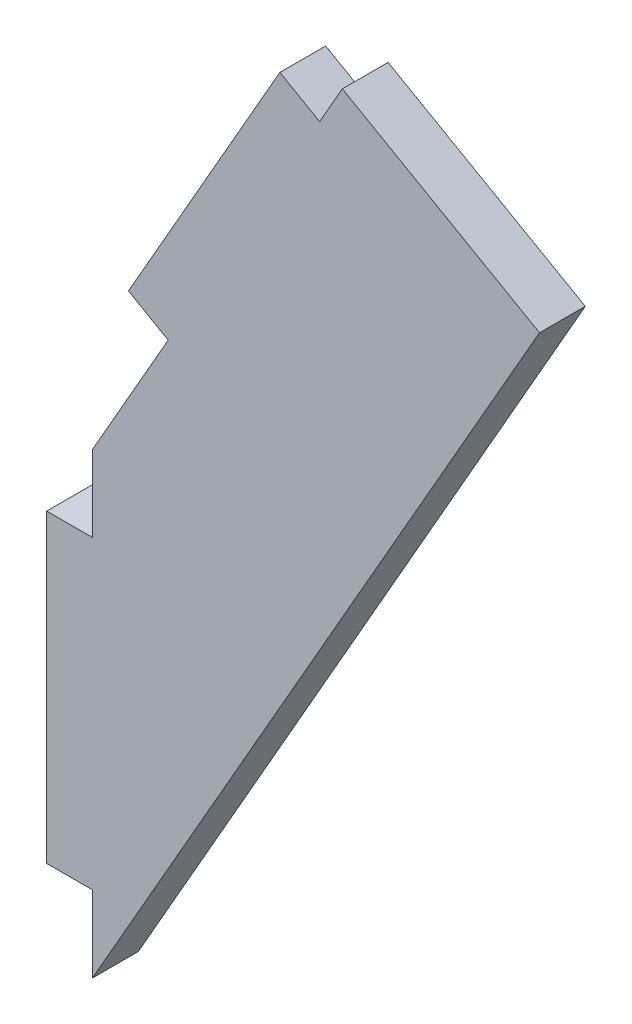
ISO-10303-21;
HEADER;
FILE_DESCRIPTION(('STEP AP214'),'2;1');
FILE_NAME('part.step','',(''),(''),'','','');
FILE_SCHEMA(('AUTOMOTIVE_DESIGN { 1 0 10303 214 1 1 1 1 }'));
ENDSEC;
DATA;
#1=APPLICATION_CONTEXT('core data for automotive mechanical design processes');
#2=APPLICATION_PROTOCOL_DEFINITION('international standard','automotive_design',2000,#1);
#3=PRODUCT_CONTEXT('',#1,'mechanical');
#4=PRODUCT('Part','Part','',(#3));
#5=PRODUCT_RELATED_PRODUCT_CATEGORY('part','',(#4));
#6=PRODUCT_DEFINITION_FORMATION('','',#4);
#7=PRODUCT_DEFINITION_CONTEXT('part definition',#1,'design');
#8=PRODUCT_DEFINITION('design','',#6,#7);
#9=PRODUCT_DEFINITION_SHAPE('','',#8);
#10=(LENGTH_UNIT() NAMED_UNIT(*) SI_UNIT(.MILLI.,.METRE.));
#11=(NAMED_UNIT(*) PLANE_ANGLE_UNIT() SI_UNIT($,.RADIAN.));
#12=(NAMED_UNIT(*) SI_UNIT($,.STERADIAN.) SOLID_ANGLE_UNIT());
#13=UNCERTAINTY_MEASURE_WITH_UNIT(LENGTH_MEASURE(1.E-05),#10,'distance_accuracy_value','');
#14=(GEOMETRIC_REPRESENTATION_CONTEXT(3) GLOBAL_UNCERTAINTY_ASSIGNED_CONTEXT((#13)) GLOBAL_UNIT_ASSIGNED_CONTEXT((#10,
#11,#12)) REPRESENTATION_CONTEXT('',''));
#15=CARTESIAN_POINT('',(0.,0.,0.));
#16=DIRECTION('',(0.,0.,1.));
#17=DIRECTION('',(1.,0.,0.));
#18=AXIS2_PLACEMENT_3D('',#15,#16,#17);
#19=CARTESIAN_POINT('',(15.2707562929104,52.5406724681879,3.01));
#20=DIRECTION('',(0.496138938356844,0.868243142124453,0.));
#21=DIRECTION('',(0.868243142124453,-0.496138938356844,0.));
#22=AXIS2_PLACEMENT_3D('',#19,#20,#21);
#23=PLANE('',#22);
#24=DIRECTION('',(0.868243142124462,-0.496138938356829,0.));
#25=VECTOR('',#24,1.);
#26=CARTESIAN_POINT('',(15.2794387243316,52.5357110788043,0.));
#27=LINE('',#26,#25);
#28=CARTESIAN_POINT('',(15.2794387243316,52.5357110788043,0.));
#29=VERTEX_POINT('',#28);
#30=CARTESIAN_POINT('',(17.884168150705,51.0472942637338,0.));
#31=VERTEX_POINT('',#30);
#32=EDGE_CURVE('E162',#29,#31,#27,.T.);
#33=ORIENTED_EDGE('',*,*,#32,.F.);
#34=DIRECTION('',(0.,0.,-1.));
#35=VECTOR('',#34,1.);
#36=CARTESIAN_POINT('',(15.2794387243316,52.5357110788043,1.5));
#37=LINE('',#36,#35);
#38=CARTESIAN_POINT('',(15.2794387243316,52.5357110788043,3.));
#39=VERTEX_POINT('',#38);
#40=EDGE_CURVE('E138',#39,#29,#37,.T.);
#41=ORIENTED_EDGE('',*,*,#40,.F.);
#42=DIRECTION('',(-0.868243142124461,0.496138938356831,0.));
#43=VECTOR('',#42,1.);
#44=CARTESIAN_POINT('',(17.884168150705,51.0472942637338,3.));
#45=LINE('',#44,#43);
#46=CARTESIAN_POINT('',(17.884168150705,51.0472942637338,3.));
#47=VERTEX_POINT('',#46);
#48=EDGE_CURVE('E155',#47,#39,#45,.T.);
#49=ORIENTED_EDGE('',*,*,#48,.F.);
#50=DIRECTION('',(0.,0.,1.));
#51=VECTOR('',#50,1.);
#52=CARTESIAN_POINT('',(17.884168150705,51.0472942637338,1.5));
#53=LINE('',#52,#51);
#54=EDGE_CURVE('E161',#31,#47,#53,.T.);
#55=ORIENTED_EDGE('',*,*,#54,.F.);
#56=EDGE_LOOP('',(#33,#41,#49,#55));
#57=FACE_BOUND('',#56,.T.);
#58=ADVANCED_FACE('F16',(#57),#23,.T.);
#59=CARTESIAN_POINT('',(5.3516985678114,35.1621658048938,3.01));
#60=DIRECTION('',(-0.86824314212446,0.496138938356833,0.));
#61=DIRECTION('',(0.496138938356833,0.86824314212446,0.));
#62=AXIS2_PLACEMENT_3D('',#59,#60,#61);
#63=PLANE('',#62);
#64=DIRECTION('',(0.496138938356832,0.86824314212446,0.));
#65=VECTOR('',#64,1.);
#66=CARTESIAN_POINT('',(5.35665995719496,35.1708482363151,0.));
#67=LINE('',#66,#65);
#68=CARTESIAN_POINT('',(5.35665995719494,35.1708482363151,0.));
#69=VERTEX_POINT('',#68);
#70=EDGE_CURVE('E126',#69,#29,#67,.T.);
#71=ORIENTED_EDGE('',*,*,#70,.F.);
#72=DIRECTION('',(0.,0.,-1.));
#73=VECTOR('',#72,1.);
#74=CARTESIAN_POINT('',(5.35665995719493,35.170848236315,1.5));
#75=LINE('',#74,#73);
#76=CARTESIAN_POINT('',(5.35665995719494,35.1708482363151,3.));
#77=VERTEX_POINT('',#76);
#78=EDGE_CURVE('E118',#77,#69,#75,.T.);
#79=ORIENTED_EDGE('',*,*,#78,.F.);
#80=DIRECTION('',(-0.496138938356832,-0.86824314212446,0.));
#81=VECTOR('',#80,1.);
#82=CARTESIAN_POINT('',(15.2794387243316,52.5357110788043,3.));
#83=LINE('',#82,#81);
#84=EDGE_CURVE('E152',#39,#77,#83,.T.);
#85=ORIENTED_EDGE('',*,*,#84,.F.);
#86=ORIENTED_EDGE('',*,*,#40,.T.);
#87=EDGE_LOOP('',(#71,#79,#85,#86));
#88=FACE_BOUND('',#87,.T.);
#89=ADVANCED_FACE('F168',(#88),#63,.T.);
#90=CARTESIAN_POINT('',(7.97007181498958,33.677470031861,3.01));
#91=DIRECTION('',(-0.496138938356823,-0.868243142124465,0.));
#92=DIRECTION('',(-0.868243142124465,0.496138938356823,0.));
#93=AXIS2_PLACEMENT_3D('',#90,#91,#92);
#94=PLANE('',#93);
#95=DIRECTION('',(-0.868243142124459,0.496138938356835,0.));
#96=VECTOR('',#95,1.);
#97=CARTESIAN_POINT('',(7.96138938356834,33.6824314212446,0.));
#98=LINE('',#97,#96);
#99=CARTESIAN_POINT('',(7.96138938356835,33.6824314212446,0.));
#100=VERTEX_POINT('',#99);
#101=EDGE_CURVE('E121',#100,#69,#98,.T.);
#102=ORIENTED_EDGE('',*,*,#101,.F.);
#103=DIRECTION('',(0.,0.,-1.));
#104=VECTOR('',#103,1.);
#105=CARTESIAN_POINT('',(7.96138938356835,33.6824314212446,1.5));
#106=LINE('',#105,#104);
#107=CARTESIAN_POINT('',(7.96138938356835,33.6824314212446,3.));
#108=VERTEX_POINT('',#107);
#109=EDGE_CURVE('E108',#108,#100,#106,.T.);
#110=ORIENTED_EDGE('',*,*,#109,.F.);
#111=DIRECTION('',(0.868243142124457,-0.496138938356837,0.));
#112=VECTOR('',#111,1.);
#113=CARTESIAN_POINT('',(5.35665995719496,35.1708482363151,3.));
#114=LINE('',#113,#112);
#115=EDGE_CURVE('E150',#77,#108,#114,.T.);
#116=ORIENTED_EDGE('',*,*,#115,.F.);
#117=ORIENTED_EDGE('',*,*,#78,.T.);
#118=EDGE_LOOP('',(#102,#110,#116,#117));
#119=FACE_BOUND('',#118,.T.);
#120=ADVANCED_FACE('F122',(#119),#94,.T.);
#121=CARTESIAN_POINT('',(7.96635077295191,33.6911138526658,-0.01));
#122=DIRECTION('',(-0.868243142124457,0.496138938356837,0.));
#123=DIRECTION('',(-0.496138938356837,-0.868243142124457,0.));
#124=AXIS2_PLACEMENT_3D('',#121,#122,#123);
#125=PLANE('',#124);
#126=DIRECTION('',(0.,0.,-1.));
#127=VECTOR('',#126,1.);
#128=CARTESIAN_POINT('',(3.,25.,1.5));
#129=LINE('',#128,#127);
#130=CARTESIAN_POINT('',(3.,25.,3.));
#131=VERTEX_POINT('',#130);
#132=CARTESIAN_POINT('',(3.,25.,0.));
#133=VERTEX_POINT('',#132);
#134=EDGE_CURVE('E103',#131,#133,#129,.T.);
#135=ORIENTED_EDGE('',*,*,#134,.F.);
#136=DIRECTION('',(-0.496138938356835,-0.868243142124459,0.));
#137=VECTOR('',#136,1.);
#138=CARTESIAN_POINT('',(7.96138938356834,33.6824314212446,3.));
#139=LINE('',#138,#137);
#140=EDGE_CURVE('E114',#108,#131,#139,.T.);
#141=ORIENTED_EDGE('',*,*,#140,.F.);
#142=ORIENTED_EDGE('',*,*,#109,.T.);
#143=DIRECTION('',(0.496138938356834,0.868243142124459,0.));
#144=VECTOR('',#143,1.);
#145=CARTESIAN_POINT('',(3.,25.,0.));
#146=LINE('',#145,#144);
#147=EDGE_CURVE('E20',#133,#100,#146,.T.);
#148=ORIENTED_EDGE('',*,*,#147,.F.);
#149=EDGE_LOOP('',(#135,#141,#142,#148));
#150=FACE_BOUND('',#149,.T.);
#151=ADVANCED_FACE('F110',(#150),#125,.T.);
#152=CARTESIAN_POINT('',(3.,25.01,-0.01));
#153=DIRECTION('',(-1.,0.,0.));
#154=DIRECTION('',(0.,-1.,0.));
#155=AXIS2_PLACEMENT_3D('',#152,#153,#154);
#156=PLANE('',#155);
#157=DIRECTION('',(0.,-1.,0.));
#158=VECTOR('',#157,1.);
#159=CARTESIAN_POINT('',(3.,24.3260118450536,3.));
#160=LINE('',#159,#158);
#161=CARTESIAN_POINT('',(3.,20.,3.));
#162=VERTEX_POINT('',#161);
#163=EDGE_CURVE('E145',#131,#162,#160,.T.);
#164=ORIENTED_EDGE('',*,*,#163,.F.);
#165=ORIENTED_EDGE('',*,*,#134,.T.);
#166=DIRECTION('',(0.,1.,0.));
#167=VECTOR('',#166,1.);
#168=CARTESIAN_POINT('',(3.,24.3260118450536,0.));
#169=LINE('',#168,#167);
#170=CARTESIAN_POINT('',(3.,20.,0.));
#171=VERTEX_POINT('',#170);
#172=EDGE_CURVE('E129',#171,#133,#169,.T.);
#173=ORIENTED_EDGE('',*,*,#172,.F.);
#174=DIRECTION('',(0.,0.,-1.));
#175=VECTOR('',#174,1.);
#176=CARTESIAN_POINT('',(3.,20.,1.5));
#177=LINE('',#176,#175);
#178=EDGE_CURVE('E180',#162,#171,#177,.T.);
#179=ORIENTED_EDGE('',*,*,#178,.F.);
#180=EDGE_LOOP('',(#164,#165,#173,#179));
#181=FACE_BOUND('',#180,.T.);
#182=ADVANCED_FACE('F233',(#181),#156,.T.);
#183=CARTESIAN_POINT('',(3.01,20.,-0.01));
#184=DIRECTION('',(0.,1.,0.));
#185=DIRECTION('',(-1.,0.,0.));
#186=AXIS2_PLACEMENT_3D('',#183,#184,#185);
#187=PLANE('',#186);
#188=DIRECTION('',(-1.,0.,0.));
#189=VECTOR('',#188,1.);
#190=CARTESIAN_POINT('',(16.1478309444262,20.,3.));
#191=LINE('',#190,#189);
#192=CARTESIAN_POINT('',(0.,20.,3.));
#193=VERTEX_POINT('',#192);
#194=EDGE_CURVE('E148',#162,#193,#191,.T.);
#195=ORIENTED_EDGE('',*,*,#194,.F.);
#196=ORIENTED_EDGE('',*,*,#178,.T.);
#197=DIRECTION('',(1.,0.,0.));
#198=VECTOR('',#197,1.);
#199=CARTESIAN_POINT('',(16.1478309444262,20.,0.));
#200=LINE('',#199,#198);
#201=CARTESIAN_POINT('',(0.,20.,0.));
#202=VERTEX_POINT('',#201);
#203=EDGE_CURVE('E130',#202,#171,#200,.T.);
#204=ORIENTED_EDGE('',*,*,#203,.F.);
#205=DIRECTION('',(0.,0.,-1.));
#206=VECTOR('',#205,1.);
#207=CARTESIAN_POINT('',(0.,20.,1.5));
#208=LINE('',#207,#206);
#209=EDGE_CURVE('E182',#193,#202,#208,.T.);
#210=ORIENTED_EDGE('',*,*,#209,.F.);
#211=EDGE_LOOP('',(#195,#196,#204,#210));
#212=FACE_BOUND('',#211,.T.);
#213=ADVANCED_FACE('F232',(#212),#187,.T.);
#214=CARTESIAN_POINT('',(0.,20.01,-0.01));
#215=DIRECTION('',(-1.,0.,0.));
#216=DIRECTION('',(0.,-1.,0.));
#217=AXIS2_PLACEMENT_3D('',#214,#215,#216);
#218=PLANE('',#217);
#219=DIRECTION('',(0.,-1.,0.));
#220=VECTOR('',#219,1.);
#221=CARTESIAN_POINT('',(0.,24.3260118450536,3.));
#222=LINE('',#221,#220);
#223=CARTESIAN_POINT('',(0.,0.,3.));
#224=VERTEX_POINT('',#223);
#225=EDGE_CURVE('E198',#193,#224,#222,.T.);
#226=ORIENTED_EDGE('',*,*,#225,.F.);
#227=ORIENTED_EDGE('',*,*,#209,.T.);
#228=DIRECTION('',(0.,1.,0.));
#229=VECTOR('',#228,1.);
#230=CARTESIAN_POINT('',(0.,24.3260118450536,0.));
#231=LINE('',#230,#229);
#232=CARTESIAN_POINT('',(0.,0.,0.));
#233=VERTEX_POINT('',#232);
#234=EDGE_CURVE('E132',#233,#202,#231,.T.);
#235=ORIENTED_EDGE('',*,*,#234,.F.);
#236=DIRECTION('',(0.,0.,-1.));
#237=VECTOR('',#236,1.);
#238=CARTESIAN_POINT('',(0.,0.,1.5));
#239=LINE('',#238,#237);
#240=EDGE_CURVE('E184',#224,#233,#239,.T.);
#241=ORIENTED_EDGE('',*,*,#240,.F.);
#242=EDGE_LOOP('',(#226,#227,#235,#241));
#243=FACE_BOUND('',#242,.T.);
#244=ADVANCED_FACE('F228',(#243),#218,.T.);
#245=CARTESIAN_POINT('',(-0.01,0.,-0.01));
#246=DIRECTION('',(0.,-1.,0.));
#247=DIRECTION('',(1.,0.,0.));
#248=AXIS2_PLACEMENT_3D('',#245,#246,#247);
#249=PLANE('',#248);
#250=DIRECTION('',(1.,0.,0.));
#251=VECTOR('',#250,1.);
#252=CARTESIAN_POINT('',(16.1478309444262,0.,3.));
#253=LINE('',#252,#251);
#254=CARTESIAN_POINT('',(3.,0.,3.));
#255=VERTEX_POINT('',#254);
#256=EDGE_CURVE('E201',#224,#255,#253,.T.);
#257=ORIENTED_EDGE('',*,*,#256,.F.);
#258=ORIENTED_EDGE('',*,*,#240,.T.);
#259=DIRECTION('',(-1.,0.,0.));
#260=VECTOR('',#259,1.);
#261=CARTESIAN_POINT('',(16.1478309444262,0.,0.));
#262=LINE('',#261,#260);
#263=CARTESIAN_POINT('',(3.,0.,0.));
#264=VERTEX_POINT('',#263);
#265=EDGE_CURVE('E191',#264,#233,#262,.T.);
#266=ORIENTED_EDGE('',*,*,#265,.F.);
#267=DIRECTION('',(0.,0.,-1.));
#268=VECTOR('',#267,1.);
#269=CARTESIAN_POINT('',(3.,0.,1.5));
#270=LINE('',#269,#268);
#271=EDGE_CURVE('E186',#255,#264,#270,.T.);
#272=ORIENTED_EDGE('',*,*,#271,.F.);
#273=EDGE_LOOP('',(#257,#258,#266,#272));
#274=FACE_BOUND('',#273,.T.);
#275=ADVANCED_FACE('F225',(#274),#249,.T.);
#276=CARTESIAN_POINT('',(3.,0.0100000000000002,-0.01));
#277=DIRECTION('',(-1.,0.,0.));
#278=DIRECTION('',(0.,-1.,0.));
#279=AXIS2_PLACEMENT_3D('',#276,#277,#278);
#280=PLANE('',#279);
#281=DIRECTION('',(0.,-1.,0.));
#282=VECTOR('',#281,1.);
#283=CARTESIAN_POINT('',(3.,24.3260118450536,3.));
#284=LINE('',#283,#282);
#285=CARTESIAN_POINT('',(3.,-5.,3.));
#286=VERTEX_POINT('',#285);
#287=EDGE_CURVE('E204',#255,#286,#284,.T.);
#288=ORIENTED_EDGE('',*,*,#287,.F.);
#289=ORIENTED_EDGE('',*,*,#271,.T.);
#290=DIRECTION('',(0.,1.,0.));
#291=VECTOR('',#290,1.);
#292=CARTESIAN_POINT('',(3.,24.3260118450536,0.));
#293=LINE('',#292,#291);
#294=CARTESIAN_POINT('',(3.,-5.,0.));
#295=VERTEX_POINT('',#294);
#296=EDGE_CURVE('E188',#295,#264,#293,.T.);
#297=ORIENTED_EDGE('',*,*,#296,.F.);
#298=DIRECTION('',(0.,0.,-1.));
#299=VECTOR('',#298,1.);
#300=CARTESIAN_POINT('',(3.,-5.,1.5));
#301=LINE('',#300,#299);
#302=EDGE_CURVE('E207',#286,#295,#301,.T.);
#303=ORIENTED_EDGE('',*,*,#302,.F.);
#304=EDGE_LOOP('',(#288,#289,#297,#303));
#305=FACE_BOUND('',#304,.T.);
#306=ADVANCED_FACE('F220',(#305),#280,.T.);
#307=CARTESIAN_POINT('',(32.3056618888524,-5.01,0.));
#308=DIRECTION('',(0.,0.,-1.));
#309=DIRECTION('',(-1.,0.,0.));
#310=AXIS2_PLACEMENT_3D('',#307,#308,#309);
#311=PLANE('',#310);
#312=ORIENTED_EDGE('',*,*,#32,.T.);
#313=DIRECTION('',(-0.496138938356843,-0.868243142124454,0.));
#314=VECTOR('',#313,1.);
#315=CARTESIAN_POINT('',(18.6283765582402,52.3496589769205,0.));
#316=LINE('',#315,#314);
#317=CARTESIAN_POINT('',(19.3725849679461,53.6520236888668,0.));
#318=VERTEX_POINT('',#317);
#319=EDGE_CURVE('E164',#318,#31,#316,.T.);
#320=ORIENTED_EDGE('',*,*,#319,.F.);
#321=DIRECTION('',(-0.86824314212446,0.496138938356832,0.));
#322=VECTOR('',#321,1.);
#323=CARTESIAN_POINT('',(25.834123427314,49.9597159977995,0.));
#324=LINE('',#323,#322);
#325=CARTESIAN_POINT('',(32.2956618866818,46.2674083067322,0.));
#326=VERTEX_POINT('',#325);
#327=EDGE_CURVE('E144',#326,#318,#324,.T.);
#328=ORIENTED_EDGE('',*,*,#327,.F.);
#329=DIRECTION('',(0.496138938356834,0.868243142124459,0.));
#330=VECTOR('',#329,1.);
#331=CARTESIAN_POINT('',(17.6478309444262,20.6337041527459,0.));
#332=LINE('',#331,#330);
#333=EDGE_CURVE('E210',#295,#326,#332,.T.);
#334=ORIENTED_EDGE('',*,*,#333,.F.);
#335=ORIENTED_EDGE('',*,*,#296,.T.);
#336=ORIENTED_EDGE('',*,*,#265,.T.);
#337=ORIENTED_EDGE('',*,*,#234,.T.);
#338=ORIENTED_EDGE('',*,*,#203,.T.);
#339=ORIENTED_EDGE('',*,*,#172,.T.);
#340=ORIENTED_EDGE('',*,*,#147,.T.);
#341=ORIENTED_EDGE('',*,*,#101,.T.);
#342=ORIENTED_EDGE('',*,*,#70,.T.);
#343=EDGE_LOOP('',(#312,#320,#328,#334,#335,#336,#337,#338,#339,#340,#341,#342));
#344=FACE_BOUND('',#343,.T.);
#345=ADVANCED_FACE('F127',(#344),#311,.T.);
#346=CARTESIAN_POINT('',(19.3775463551591,53.6607061215284,-0.01));
#347=DIRECTION('',(-0.868243142124454,0.496138938356843,0.));
#348=DIRECTION('',(-0.496138938356843,-0.868243142124454,0.));
#349=AXIS2_PLACEMENT_3D('',#346,#347,#348);
#350=PLANE('',#349);
#351=ORIENTED_EDGE('',*,*,#54,.T.);
#352=DIRECTION('',(-0.496138938356829,-0.868243142124462,0.));
#353=VECTOR('',#352,1.);
#354=CARTESIAN_POINT('',(19.3725849657755,53.6520236901072,3.));
#355=LINE('',#354,#353);
#356=CARTESIAN_POINT('',(19.3725849657755,53.6520236901072,3.));
#357=VERTEX_POINT('',#356);
#358=EDGE_CURVE('E158',#357,#47,#355,.T.);
#359=ORIENTED_EDGE('',*,*,#358,.F.);
#360=DIRECTION('',(0.,0.,1.));
#361=VECTOR('',#360,1.);
#362=CARTESIAN_POINT('',(19.3725849657755,53.6520236901072,1.5));
#363=LINE('',#362,#361);
#364=EDGE_CURVE('E141',#318,#357,#363,.T.);
#365=ORIENTED_EDGE('',*,*,#364,.F.);
#366=ORIENTED_EDGE('',*,*,#319,.T.);
#367=EDGE_LOOP('',(#351,#359,#365,#366));
#368=FACE_BOUND('',#367,.T.);
#369=ADVANCED_FACE('F177',(#368),#350,.T.);
#370=CARTESIAN_POINT('',(-0.00999999999999891,-5.01,3.));
#371=DIRECTION('',(0.,0.,1.));
#372=DIRECTION('',(1.,0.,0.));
#373=AXIS2_PLACEMENT_3D('',#370,#371,#372);
#374=PLANE('',#373);
#375=ORIENTED_EDGE('',*,*,#287,.T.);
#376=DIRECTION('',(-0.496138938356834,-0.868243142124459,0.));
#377=VECTOR('',#376,1.);
#378=CARTESIAN_POINT('',(17.6478309444262,20.6337041527459,3.));
#379=LINE('',#378,#377);
#380=CARTESIAN_POINT('',(32.2956618866818,46.2674083067322,3.));
#381=VERTEX_POINT('',#380);
#382=EDGE_CURVE('E35',#381,#286,#379,.T.);
#383=ORIENTED_EDGE('',*,*,#382,.F.);
#384=DIRECTION('',(0.86824314212446,-0.496138938356832,0.));
#385=VECTOR('',#384,1.);
#386=CARTESIAN_POINT('',(25.834123427314,49.9597159977994,3.));
#387=LINE('',#386,#385);
#388=EDGE_CURVE('E26',#357,#381,#387,.T.);
#389=ORIENTED_EDGE('',*,*,#388,.F.);
#390=ORIENTED_EDGE('',*,*,#358,.T.);
#391=ORIENTED_EDGE('',*,*,#48,.T.);
#392=ORIENTED_EDGE('',*,*,#84,.T.);
#393=ORIENTED_EDGE('',*,*,#115,.T.);
#394=ORIENTED_EDGE('',*,*,#140,.T.);
#395=ORIENTED_EDGE('',*,*,#163,.T.);
#396=ORIENTED_EDGE('',*,*,#194,.T.);
#397=ORIENTED_EDGE('',*,*,#225,.T.);
#398=ORIENTED_EDGE('',*,*,#256,.T.);
#399=EDGE_LOOP('',(#375,#383,#389,#390,#391,#392,#393,#394,#395,#396,#397,#398));
#400=FACE_BOUND('',#399,.T.);
#401=ADVANCED_FACE('F247',(#400),#374,.T.);
#402=CARTESIAN_POINT('',(2.99503861061643,-5.00868243142124,-0.01));
#403=DIRECTION('',(0.868243142124459,-0.496138938356834,0.));
#404=DIRECTION('',(0.496138938356834,0.868243142124459,0.));
#405=AXIS2_PLACEMENT_3D('',#402,#403,#404);
#406=PLANE('',#405);
#407=ORIENTED_EDGE('',*,*,#302,.T.);
#408=ORIENTED_EDGE('',*,*,#333,.T.);
#409=DIRECTION('',(0.,0.,-1.));
#410=VECTOR('',#409,1.);
#411=CARTESIAN_POINT('',(32.2956618888524,46.2674083054918,1.5));
#412=LINE('',#411,#410);
#413=EDGE_CURVE('E11',#381,#326,#412,.T.);
#414=ORIENTED_EDGE('',*,*,#413,.F.);
#415=ORIENTED_EDGE('',*,*,#382,.T.);
#416=EDGE_LOOP('',(#407,#408,#414,#415));
#417=FACE_BOUND('',#416,.T.);
#418=ADVANCED_FACE('F216',(#417),#406,.T.);
#419=CARTESIAN_POINT('',(19.3639025343543,53.6569850794907,3.01));
#420=DIRECTION('',(0.496138938356832,0.86824314212446,0.));
#421=DIRECTION('',(0.86824314212446,-0.496138938356832,0.));
#422=AXIS2_PLACEMENT_3D('',#419,#420,#421);
#423=PLANE('',#422);
#424=ORIENTED_EDGE('',*,*,#388,.T.);
#425=ORIENTED_EDGE('',*,*,#413,.T.);
#426=ORIENTED_EDGE('',*,*,#327,.T.);
#427=ORIENTED_EDGE('',*,*,#364,.T.);
#428=EDGE_LOOP('',(#424,#425,#426,#427));
#429=FACE_BOUND('',#428,.T.);
#430=ADVANCED_FACE('F18',(#429),#423,.T.);
#431=CLOSED_SHELL('',(#58,#89,#120,#151,#182,#213,#244,#275,#306,#345,#369,#401,#418,#430));
#432=MANIFOLD_SOLID_BREP('B1',#431);
#433=ADVANCED_BREP_SHAPE_REPRESENTATION('',(#18,#432),#14);
#434=SHAPE_DEFINITION_REPRESENTATION(#9,#433);
ENDSEC;
END-ISO-10303-21;
